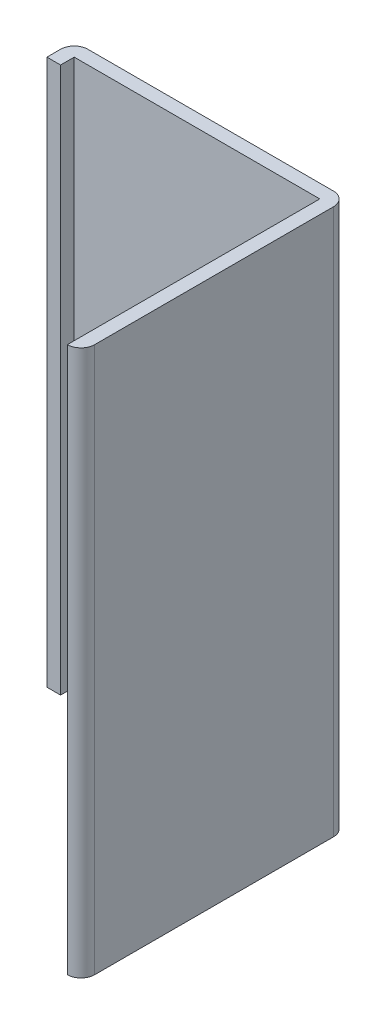
ISO-10303-21;
HEADER;
FILE_DESCRIPTION(('STEP AP214'),'2;1');
FILE_NAME('part.step','',(''),(''),'','','');
FILE_SCHEMA(('AUTOMOTIVE_DESIGN { 1 0 10303 214 1 1 1 1 }'));
ENDSEC;
DATA;
#1=APPLICATION_CONTEXT('core data for automotive mechanical design processes');
#2=APPLICATION_PROTOCOL_DEFINITION('international standard','automotive_design',2000,#1);
#3=PRODUCT_CONTEXT('',#1,'mechanical');
#4=PRODUCT('Part','Part','',(#3));
#5=PRODUCT_RELATED_PRODUCT_CATEGORY('part','',(#4));
#6=PRODUCT_DEFINITION_FORMATION('','',#4);
#7=PRODUCT_DEFINITION_CONTEXT('part definition',#1,'design');
#8=PRODUCT_DEFINITION('design','',#6,#7);
#9=PRODUCT_DEFINITION_SHAPE('','',#8);
#10=(LENGTH_UNIT() NAMED_UNIT(*) SI_UNIT(.MILLI.,.METRE.));
#11=(NAMED_UNIT(*) PLANE_ANGLE_UNIT() SI_UNIT($,.RADIAN.));
#12=(NAMED_UNIT(*) SI_UNIT($,.STERADIAN.) SOLID_ANGLE_UNIT());
#13=UNCERTAINTY_MEASURE_WITH_UNIT(LENGTH_MEASURE(1.E-05),#10,'distance_accuracy_value','');
#14=(GEOMETRIC_REPRESENTATION_CONTEXT(3) GLOBAL_UNCERTAINTY_ASSIGNED_CONTEXT((#13)) GLOBAL_UNIT_ASSIGNED_CONTEXT((#10,
#11,#12)) REPRESENTATION_CONTEXT('',''));
#15=CARTESIAN_POINT('',(0.,0.,0.));
#16=DIRECTION('',(0.,0.,1.));
#17=DIRECTION('',(1.,0.,0.));
#18=AXIS2_PLACEMENT_3D('',#15,#16,#17);
#19=CARTESIAN_POINT('',(-0.0762,-0.508,0.0254));
#20=DIRECTION('',(0.,0.,-1.));
#21=DIRECTION('',(-1.,0.,0.));
#22=AXIS2_PLACEMENT_3D('',#19,#20,#21);
#23=PLANE('',#22);
#24=DIRECTION('',(0.,1.,0.));
#25=VECTOR('',#24,1.);
#26=CARTESIAN_POINT('',(0.381,-0.508,0.0254));
#27=LINE('',#26,#25);
#28=CARTESIAN_POINT('',(0.381,-0.508,0.0254));
#29=VERTEX_POINT('',#28);
#30=CARTESIAN_POINT('',(0.381,0.508,0.0254));
#31=VERTEX_POINT('',#30);
#32=EDGE_CURVE('E124',#29,#31,#27,.T.);
#33=ORIENTED_EDGE('',*,*,#32,.T.);
#34=DIRECTION('',(1.,0.,0.));
#35=VECTOR('',#34,1.);
#36=CARTESIAN_POINT('',(0.381,0.508,0.0254));
#37=LINE('',#36,#35);
#38=CARTESIAN_POINT('',(-0.0762,0.508,0.0254));
#39=VERTEX_POINT('',#38);
#40=EDGE_CURVE('E111',#31,#39,#37,.F.);
#41=ORIENTED_EDGE('',*,*,#40,.T.);
#42=DIRECTION('',(0.,1.,0.));
#43=VECTOR('',#42,1.);
#44=CARTESIAN_POINT('',(-0.0762,-0.508,0.0254));
#45=LINE('',#44,#43);
#46=CARTESIAN_POINT('',(-0.0762,-0.508,0.0254));
#47=VERTEX_POINT('',#46);
#48=EDGE_CURVE('E107',#39,#47,#45,.F.);
#49=ORIENTED_EDGE('',*,*,#48,.T.);
#50=DIRECTION('',(1.,0.,0.));
#51=VECTOR('',#50,1.);
#52=CARTESIAN_POINT('',(0.381,-0.508,0.0254));
#53=LINE('',#52,#51);
#54=EDGE_CURVE('E125',#29,#47,#53,.F.);
#55=ORIENTED_EDGE('',*,*,#54,.F.);
#56=EDGE_LOOP('',(#33,#41,#49,#55));
#57=FACE_BOUND('',#56,.T.);
#58=ADVANCED_FACE('F16',(#57),#23,.F.);
#59=CARTESIAN_POINT('',(-0.0762,-0.508,0.0508));
#60=DIRECTION('',(-1.,0.,0.));
#61=DIRECTION('',(0.,0.,1.));
#62=AXIS2_PLACEMENT_3D('',#59,#60,#61);
#63=PLANE('',#62);
#64=ORIENTED_EDGE('',*,*,#48,.F.);
#65=DIRECTION('',(0.,0.,-1.));
#66=VECTOR('',#65,1.);
#67=CARTESIAN_POINT('',(-0.0762,0.508,0.0254));
#68=LINE('',#67,#66);
#69=CARTESIAN_POINT('',(-0.0762,0.508,0.0508));
#70=VERTEX_POINT('',#69);
#71=EDGE_CURVE('E119',#39,#70,#68,.F.);
#72=ORIENTED_EDGE('',*,*,#71,.T.);
#73=DIRECTION('',(0.,1.,0.));
#74=VECTOR('',#73,1.);
#75=CARTESIAN_POINT('',(-0.0762,-0.508,0.0508));
#76=LINE('',#75,#74);
#77=CARTESIAN_POINT('',(-0.0762,-0.508,0.0508));
#78=VERTEX_POINT('',#77);
#79=EDGE_CURVE('E176',#70,#78,#76,.F.);
#80=ORIENTED_EDGE('',*,*,#79,.T.);
#81=DIRECTION('',(0.,0.,-1.));
#82=VECTOR('',#81,1.);
#83=CARTESIAN_POINT('',(-0.0762,-0.508,0.0254));
#84=LINE('',#83,#82);
#85=EDGE_CURVE('E167',#47,#78,#84,.F.);
#86=ORIENTED_EDGE('',*,*,#85,.F.);
#87=EDGE_LOOP('',(#64,#72,#80,#86));
#88=FACE_BOUND('',#87,.T.);
#89=ADVANCED_FACE('F226',(#88),#63,.F.);
#90=CARTESIAN_POINT('',(-0.1016,-0.508,0.0508));
#91=DIRECTION('',(0.,0.,-1.));
#92=DIRECTION('',(-1.,0.,0.));
#93=AXIS2_PLACEMENT_3D('',#90,#91,#92);
#94=PLANE('',#93);
#95=ORIENTED_EDGE('',*,*,#79,.F.);
#96=DIRECTION('',(1.,0.,0.));
#97=VECTOR('',#96,1.);
#98=CARTESIAN_POINT('',(0.381,0.508,0.0508));
#99=LINE('',#98,#97);
#100=CARTESIAN_POINT('',(-0.1016,0.508,0.0508));
#101=VERTEX_POINT('',#100);
#102=EDGE_CURVE('E144',#70,#101,#99,.F.);
#103=ORIENTED_EDGE('',*,*,#102,.T.);
#104=DIRECTION('',(0.,1.,0.));
#105=VECTOR('',#104,1.);
#106=CARTESIAN_POINT('',(-0.1016,-0.508,0.0508));
#107=LINE('',#106,#105);
#108=CARTESIAN_POINT('',(-0.1016,-0.508,0.0508));
#109=VERTEX_POINT('',#108);
#110=EDGE_CURVE('E183',#101,#109,#107,.F.);
#111=ORIENTED_EDGE('',*,*,#110,.T.);
#112=DIRECTION('',(1.,0.,0.));
#113=VECTOR('',#112,1.);
#114=CARTESIAN_POINT('',(0.381,-0.508,0.0508));
#115=LINE('',#114,#113);
#116=EDGE_CURVE('E85',#78,#109,#115,.F.);
#117=ORIENTED_EDGE('',*,*,#116,.F.);
#118=EDGE_LOOP('',(#95,#103,#111,#117));
#119=FACE_BOUND('',#118,.T.);
#120=ADVANCED_FACE('F225',(#119),#94,.F.);
#121=CARTESIAN_POINT('',(-0.1016,-0.508,0.0254));
#122=DIRECTION('',(1.,0.,0.));
#123=DIRECTION('',(0.,0.,-1.));
#124=AXIS2_PLACEMENT_3D('',#121,#122,#123);
#125=PLANE('',#124);
#126=ORIENTED_EDGE('',*,*,#110,.F.);
#127=DIRECTION('',(0.,0.,-1.));
#128=VECTOR('',#127,1.);
#129=CARTESIAN_POINT('',(-0.1016,0.508,0.0254));
#130=LINE('',#129,#128);
#131=CARTESIAN_POINT('',(-0.1016,0.508,0.0254));
#132=VERTEX_POINT('',#131);
#133=EDGE_CURVE('E147',#101,#132,#130,.T.);
#134=ORIENTED_EDGE('',*,*,#133,.T.);
#135=DIRECTION('',(0.,-1.,0.));
#136=VECTOR('',#135,1.);
#137=CARTESIAN_POINT('',(-0.1016,-0.508,0.0254));
#138=LINE('',#137,#136);
#139=CARTESIAN_POINT('',(-0.1016,-0.508,0.0254));
#140=VERTEX_POINT('',#139);
#141=EDGE_CURVE('E133',#140,#132,#138,.F.);
#142=ORIENTED_EDGE('',*,*,#141,.F.);
#143=DIRECTION('',(0.,0.,-1.));
#144=VECTOR('',#143,1.);
#145=CARTESIAN_POINT('',(-0.1016,-0.508,0.0254));
#146=LINE('',#145,#144);
#147=EDGE_CURVE('E79',#109,#140,#146,.T.);
#148=ORIENTED_EDGE('',*,*,#147,.F.);
#149=EDGE_LOOP('',(#126,#134,#142,#148));
#150=FACE_BOUND('',#149,.T.);
#151=ADVANCED_FACE('F223',(#150),#125,.F.);
#152=CARTESIAN_POINT('',(0.4064,-0.508,0.4699));
#153=DIRECTION('',(-1.,0.,0.));
#154=DIRECTION('',(0.,0.,1.));
#155=AXIS2_PLACEMENT_3D('',#152,#153,#154);
#156=PLANE('',#155);
#157=DIRECTION('',(0.,-1.,0.));
#158=VECTOR('',#157,1.);
#159=CARTESIAN_POINT('',(0.4064,-0.508,0.0254));
#160=LINE('',#159,#158);
#161=CARTESIAN_POINT('',(0.4064,0.508,0.0254));
#162=VERTEX_POINT('',#161);
#163=CARTESIAN_POINT('',(0.4064,-0.508,0.0254));
#164=VERTEX_POINT('',#163);
#165=EDGE_CURVE('E73',#162,#164,#160,.T.);
#166=ORIENTED_EDGE('',*,*,#165,.F.);
#167=DIRECTION('',(0.,0.,-1.));
#168=VECTOR('',#167,1.);
#169=CARTESIAN_POINT('',(0.4064,0.508,0.0254));
#170=LINE('',#169,#168);
#171=CARTESIAN_POINT('',(0.4064,0.508,0.4699));
#172=VERTEX_POINT('',#171);
#173=EDGE_CURVE('E138',#162,#172,#170,.F.);
#174=ORIENTED_EDGE('',*,*,#173,.T.);
#175=DIRECTION('',(0.,-1.,0.));
#176=VECTOR('',#175,1.);
#177=CARTESIAN_POINT('',(0.4064,-0.508,0.4699));
#178=LINE('',#177,#176);
#179=CARTESIAN_POINT('',(0.4064,-0.508,0.4699));
#180=VERTEX_POINT('',#179);
#181=EDGE_CURVE('E189',#180,#172,#178,.F.);
#182=ORIENTED_EDGE('',*,*,#181,.F.);
#183=DIRECTION('',(0.,0.,-1.));
#184=VECTOR('',#183,1.);
#185=CARTESIAN_POINT('',(0.4064,-0.508,0.0254));
#186=LINE('',#185,#184);
#187=EDGE_CURVE('E159',#164,#180,#186,.F.);
#188=ORIENTED_EDGE('',*,*,#187,.F.);
#189=EDGE_LOOP('',(#166,#174,#182,#188));
#190=FACE_BOUND('',#189,.T.);
#191=ADVANCED_FACE('F215',(#190),#156,.F.);
#192=CARTESIAN_POINT('',(0.381,-0.508,0.4699));
#193=DIRECTION('',(0.,-1.,0.));
#194=DIRECTION('',(0.,0.,-1.));
#195=AXIS2_PLACEMENT_3D('',#192,#193,#194);
#196=CYLINDRICAL_SURFACE('',#195,0.0254);
#197=CARTESIAN_POINT('',(0.381,0.508,0.4699));
#198=DIRECTION('',(0.,-1.,0.));
#199=DIRECTION('',(0.,0.,-1.));
#200=AXIS2_PLACEMENT_3D('',#197,#198,#199);
#201=CIRCLE('',#200,0.0254);
#202=CARTESIAN_POINT('',(0.381,0.508,0.4953));
#203=VERTEX_POINT('',#202);
#204=EDGE_CURVE('E134',#172,#203,#201,.T.);
#205=ORIENTED_EDGE('',*,*,#204,.T.);
#206=DIRECTION('',(0.,1.,0.));
#207=VECTOR('',#206,1.);
#208=CARTESIAN_POINT('',(0.381,-0.508,0.4953));
#209=LINE('',#208,#207);
#210=CARTESIAN_POINT('',(0.381,-0.508,0.4953));
#211=VERTEX_POINT('',#210);
#212=EDGE_CURVE('E128',#203,#211,#209,.F.);
#213=ORIENTED_EDGE('',*,*,#212,.T.);
#214=CARTESIAN_POINT('',(0.381,-0.508,0.4699));
#215=DIRECTION('',(0.,-1.,0.));
#216=DIRECTION('',(0.,0.,-1.));
#217=AXIS2_PLACEMENT_3D('',#214,#215,#216);
#218=CIRCLE('',#217,0.0254);
#219=EDGE_CURVE('E155',#180,#211,#218,.T.);
#220=ORIENTED_EDGE('',*,*,#219,.F.);
#221=ORIENTED_EDGE('',*,*,#181,.T.);
#222=EDGE_LOOP('',(#205,#213,#220,#221));
#223=FACE_BOUND('',#222,.T.);
#224=ADVANCED_FACE('F217',(#223),#196,.T.);
#225=CARTESIAN_POINT('',(0.381,-0.508,0.0254));
#226=DIRECTION('',(1.,0.,0.));
#227=DIRECTION('',(0.,0.,-1.));
#228=AXIS2_PLACEMENT_3D('',#225,#226,#227);
#229=PLANE('',#228);
#230=DIRECTION('',(0.,0.,-1.));
#231=VECTOR('',#230,1.);
#232=CARTESIAN_POINT('',(0.381,-0.508,0.0254));
#233=LINE('',#232,#231);
#234=EDGE_CURVE('E158',#211,#29,#233,.T.);
#235=ORIENTED_EDGE('',*,*,#234,.F.);
#236=ORIENTED_EDGE('',*,*,#212,.F.);
#237=DIRECTION('',(0.,0.,-1.));
#238=VECTOR('',#237,1.);
#239=CARTESIAN_POINT('',(0.381,0.508,0.0254));
#240=LINE('',#239,#238);
#241=EDGE_CURVE('E116',#203,#31,#240,.T.);
#242=ORIENTED_EDGE('',*,*,#241,.T.);
#243=ORIENTED_EDGE('',*,*,#32,.F.);
#244=EDGE_LOOP('',(#235,#236,#242,#243));
#245=FACE_BOUND('',#244,.T.);
#246=ADVANCED_FACE('F130',(#245),#229,.F.);
#247=CARTESIAN_POINT('',(0.381,-0.508,0.0254));
#248=DIRECTION('',(0.,-1.,0.));
#249=DIRECTION('',(0.,0.,-1.));
#250=AXIS2_PLACEMENT_3D('',#247,#248,#249);
#251=CYLINDRICAL_SURFACE('',#250,0.0254);
#252=CARTESIAN_POINT('',(0.381,0.508,0.0254));
#253=DIRECTION('',(0.,-1.,0.));
#254=DIRECTION('',(0.,0.,-1.));
#255=AXIS2_PLACEMENT_3D('',#252,#253,#254);
#256=CIRCLE('',#255,0.0254);
#257=CARTESIAN_POINT('',(0.381,0.508,0.));
#258=VERTEX_POINT('',#257);
#259=EDGE_CURVE('E19',#258,#162,#256,.T.);
#260=ORIENTED_EDGE('',*,*,#259,.T.);
#261=ORIENTED_EDGE('',*,*,#165,.T.);
#262=CARTESIAN_POINT('',(0.381,-0.508,0.0254));
#263=DIRECTION('',(0.,-1.,0.));
#264=DIRECTION('',(0.,0.,-1.));
#265=AXIS2_PLACEMENT_3D('',#262,#263,#264);
#266=CIRCLE('',#265,0.0254);
#267=CARTESIAN_POINT('',(0.381,-0.508,0.));
#268=VERTEX_POINT('',#267);
#269=EDGE_CURVE('E160',#268,#164,#266,.T.);
#270=ORIENTED_EDGE('',*,*,#269,.F.);
#271=DIRECTION('',(0.,1.,0.));
#272=VECTOR('',#271,1.);
#273=CARTESIAN_POINT('',(0.381,-0.508,0.));
#274=LINE('',#273,#272);
#275=EDGE_CURVE('E63',#268,#258,#274,.T.);
#276=ORIENTED_EDGE('',*,*,#275,.T.);
#277=EDGE_LOOP('',(#260,#261,#270,#276));
#278=FACE_BOUND('',#277,.T.);
#279=ADVANCED_FACE('F218',(#278),#251,.T.);
#280=CARTESIAN_POINT('',(0.381,0.508,0.0254));
#281=DIRECTION('',(0.,-1.,0.));
#282=DIRECTION('',(0.,0.,-1.));
#283=AXIS2_PLACEMENT_3D('',#280,#281,#282);
#284=PLANE('',#283);
#285=ORIENTED_EDGE('',*,*,#241,.F.);
#286=ORIENTED_EDGE('',*,*,#204,.F.);
#287=ORIENTED_EDGE('',*,*,#173,.F.);
#288=ORIENTED_EDGE('',*,*,#259,.F.);
#289=DIRECTION('',(1.,0.,0.));
#290=VECTOR('',#289,1.);
#291=CARTESIAN_POINT('',(0.381,0.508,0.));
#292=LINE('',#291,#290);
#293=CARTESIAN_POINT('',(-0.0762,0.508,0.));
#294=VERTEX_POINT('',#293);
#295=EDGE_CURVE('E203',#258,#294,#292,.F.);
#296=ORIENTED_EDGE('',*,*,#295,.T.);
#297=CARTESIAN_POINT('',(-0.0762,0.508,0.0254));
#298=DIRECTION('',(0.,-1.,0.));
#299=DIRECTION('',(0.,0.,-1.));
#300=AXIS2_PLACEMENT_3D('',#297,#298,#299);
#301=CIRCLE('',#300,0.0254);
#302=EDGE_CURVE('E136',#132,#294,#301,.T.);
#303=ORIENTED_EDGE('',*,*,#302,.F.);
#304=ORIENTED_EDGE('',*,*,#133,.F.);
#305=ORIENTED_EDGE('',*,*,#102,.F.);
#306=ORIENTED_EDGE('',*,*,#71,.F.);
#307=ORIENTED_EDGE('',*,*,#40,.F.);
#308=EDGE_LOOP('',(#285,#286,#287,#288,#296,#303,#304,#305,#306,#307));
#309=FACE_BOUND('',#308,.T.);
#310=ADVANCED_FACE('F113',(#309),#284,.F.);
#311=CARTESIAN_POINT('',(-0.0762,-0.508,0.0254));
#312=DIRECTION('',(0.,-1.,0.));
#313=DIRECTION('',(0.,0.,-1.));
#314=AXIS2_PLACEMENT_3D('',#311,#312,#313);
#315=CYLINDRICAL_SURFACE('',#314,0.0254);
#316=ORIENTED_EDGE('',*,*,#302,.T.);
#317=DIRECTION('',(0.,1.,0.));
#318=VECTOR('',#317,1.);
#319=CARTESIAN_POINT('',(-0.0762,-0.508,0.));
#320=LINE('',#319,#318);
#321=CARTESIAN_POINT('',(-0.0762,-0.508,0.));
#322=VERTEX_POINT('',#321);
#323=EDGE_CURVE('E25',#294,#322,#320,.F.);
#324=ORIENTED_EDGE('',*,*,#323,.T.);
#325=CARTESIAN_POINT('',(-0.0762,-0.508,0.0254));
#326=DIRECTION('',(0.,-1.,0.));
#327=DIRECTION('',(0.,0.,-1.));
#328=AXIS2_PLACEMENT_3D('',#325,#326,#327);
#329=CIRCLE('',#328,0.0254);
#330=EDGE_CURVE('E33',#140,#322,#329,.T.);
#331=ORIENTED_EDGE('',*,*,#330,.F.);
#332=ORIENTED_EDGE('',*,*,#141,.T.);
#333=EDGE_LOOP('',(#316,#324,#331,#332));
#334=FACE_BOUND('',#333,.T.);
#335=ADVANCED_FACE('F220',(#334),#315,.T.);
#336=CARTESIAN_POINT('',(0.381,-0.508,0.0254));
#337=DIRECTION('',(0.,-1.,0.));
#338=DIRECTION('',(0.,0.,-1.));
#339=AXIS2_PLACEMENT_3D('',#336,#337,#338);
#340=PLANE('',#339);
#341=ORIENTED_EDGE('',*,*,#219,.T.);
#342=ORIENTED_EDGE('',*,*,#234,.T.);
#343=ORIENTED_EDGE('',*,*,#54,.T.);
#344=ORIENTED_EDGE('',*,*,#85,.T.);
#345=ORIENTED_EDGE('',*,*,#116,.T.);
#346=ORIENTED_EDGE('',*,*,#147,.T.);
#347=ORIENTED_EDGE('',*,*,#330,.T.);
#348=DIRECTION('',(1.,0.,0.));
#349=VECTOR('',#348,1.);
#350=CARTESIAN_POINT('',(0.381,-0.508,0.));
#351=LINE('',#350,#349);
#352=EDGE_CURVE('E11',#322,#268,#351,.T.);
#353=ORIENTED_EDGE('',*,*,#352,.T.);
#354=ORIENTED_EDGE('',*,*,#269,.T.);
#355=ORIENTED_EDGE('',*,*,#187,.T.);
#356=EDGE_LOOP('',(#341,#342,#343,#344,#345,#346,#347,#353,#354,#355));
#357=FACE_BOUND('',#356,.T.);
#358=ADVANCED_FACE('F212',(#357),#340,.T.);
#359=CARTESIAN_POINT('',(0.381,-0.508,0.));
#360=DIRECTION('',(0.,0.,1.));
#361=DIRECTION('',(1.,0.,0.));
#362=AXIS2_PLACEMENT_3D('',#359,#360,#361);
#363=PLANE('',#362);
#364=ORIENTED_EDGE('',*,*,#323,.F.);
#365=ORIENTED_EDGE('',*,*,#295,.F.);
#366=ORIENTED_EDGE('',*,*,#275,.F.);
#367=ORIENTED_EDGE('',*,*,#352,.F.);
#368=EDGE_LOOP('',(#364,#365,#366,#367));
#369=FACE_BOUND('',#368,.T.);
#370=ADVANCED_FACE('F219',(#369),#363,.F.);
#371=CLOSED_SHELL('',(#58,#89,#120,#151,#191,#224,#246,#279,#310,#335,#358,#370));
#372=MANIFOLD_SOLID_BREP('B1',#371);
#373=ADVANCED_BREP_SHAPE_REPRESENTATION('',(#18,#372),#14);
#374=SHAPE_DEFINITION_REPRESENTATION(#9,#373);
ENDSEC;
END-ISO-10303-21;
